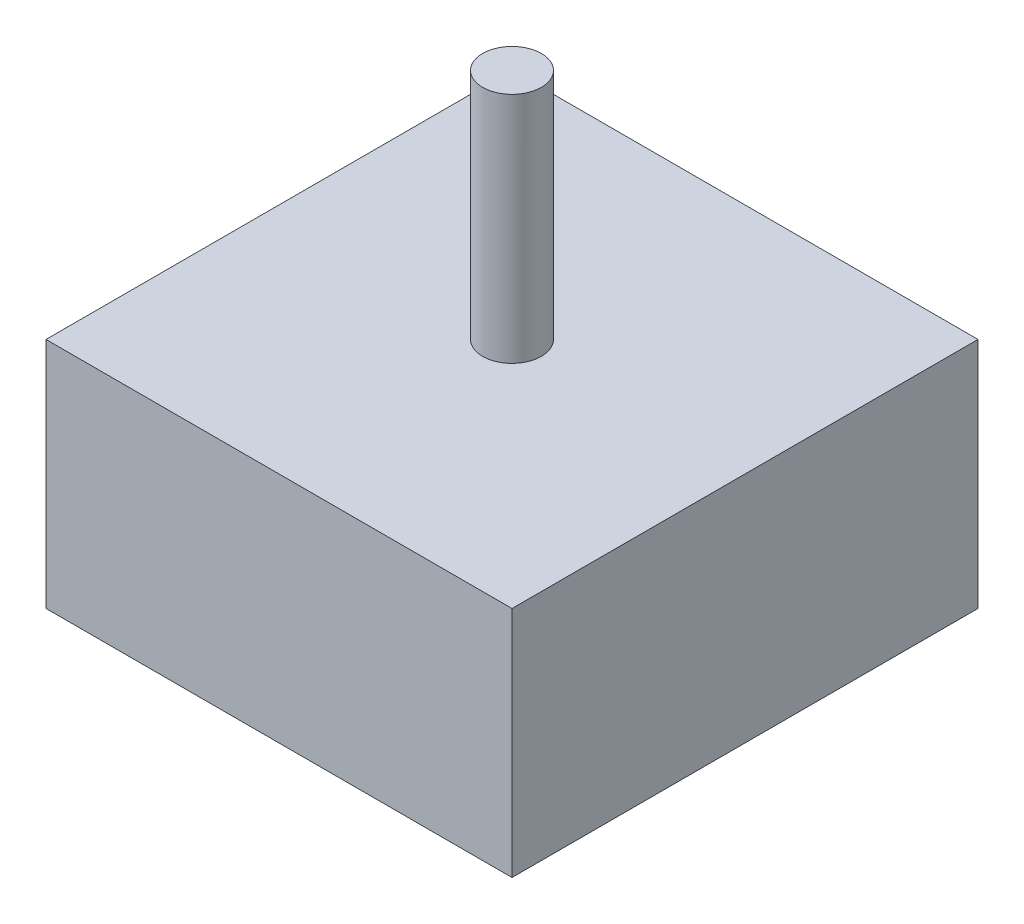
ISO-10303-21;
HEADER;
FILE_DESCRIPTION(('STEP AP214'),'2;1');
FILE_NAME('part.step','',(''),(''),'','','');
FILE_SCHEMA(('AUTOMOTIVE_DESIGN { 1 0 10303 214 1 1 1 1 }'));
ENDSEC;
DATA;
#1=APPLICATION_CONTEXT('core data for automotive mechanical design processes');
#2=APPLICATION_PROTOCOL_DEFINITION('international standard','automotive_design',2000,#1);
#3=PRODUCT_CONTEXT('',#1,'mechanical');
#4=PRODUCT('Part','Part','',(#3));
#5=PRODUCT_RELATED_PRODUCT_CATEGORY('part','',(#4));
#6=PRODUCT_DEFINITION_FORMATION('','',#4);
#7=PRODUCT_DEFINITION_CONTEXT('part definition',#1,'design');
#8=PRODUCT_DEFINITION('design','',#6,#7);
#9=PRODUCT_DEFINITION_SHAPE('','',#8);
#10=(LENGTH_UNIT() NAMED_UNIT(*) SI_UNIT(.MILLI.,.METRE.));
#11=(NAMED_UNIT(*) PLANE_ANGLE_UNIT() SI_UNIT($,.RADIAN.));
#12=(NAMED_UNIT(*) SI_UNIT($,.STERADIAN.) SOLID_ANGLE_UNIT());
#13=UNCERTAINTY_MEASURE_WITH_UNIT(LENGTH_MEASURE(1.E-05),#10,'distance_accuracy_value','');
#14=(GEOMETRIC_REPRESENTATION_CONTEXT(3) GLOBAL_UNCERTAINTY_ASSIGNED_CONTEXT((#13)) GLOBAL_UNIT_ASSIGNED_CONTEXT((#10,
#11,#12)) REPRESENTATION_CONTEXT('',''));
#15=CARTESIAN_POINT('',(0.,0.,0.));
#16=DIRECTION('',(0.,0.,1.));
#17=DIRECTION('',(1.,0.,0.));
#18=AXIS2_PLACEMENT_3D('',#15,#16,#17);
#19=CARTESIAN_POINT('',(0.,25.,0.));
#20=DIRECTION('',(0.,-1.,0.));
#21=DIRECTION('',(0.,0.,-1.));
#22=AXIS2_PLACEMENT_3D('',#19,#20,#21);
#23=PLANE('',#22);
#24=DIRECTION('',(0.,0.,-1.));
#25=VECTOR('',#24,1.);
#26=CARTESIAN_POINT('',(25.,25.,25.));
#27=LINE('',#26,#25);
#28=CARTESIAN_POINT('',(25.,25.,25.));
#29=VERTEX_POINT('',#28);
#30=CARTESIAN_POINT('',(25.,25.,-25.));
#31=VERTEX_POINT('',#30);
#32=EDGE_CURVE('E150',#29,#31,#27,.T.);
#33=ORIENTED_EDGE('',*,*,#32,.T.);
#34=DIRECTION('',(-1.,0.,0.));
#35=VECTOR('',#34,1.);
#36=CARTESIAN_POINT('',(-25.,25.,-25.));
#37=LINE('',#36,#35);
#38=CARTESIAN_POINT('',(-25.,25.,-25.));
#39=VERTEX_POINT('',#38);
#40=EDGE_CURVE('E86',#31,#39,#37,.T.);
#41=ORIENTED_EDGE('',*,*,#40,.T.);
#42=DIRECTION('',(0.,0.,1.));
#43=VECTOR('',#42,1.);
#44=CARTESIAN_POINT('',(-25.,25.,25.));
#45=LINE('',#44,#43);
#46=CARTESIAN_POINT('',(-25.,25.,25.));
#47=VERTEX_POINT('',#46);
#48=EDGE_CURVE('E153',#39,#47,#45,.T.);
#49=ORIENTED_EDGE('',*,*,#48,.T.);
#50=DIRECTION('',(1.,0.,0.));
#51=VECTOR('',#50,1.);
#52=CARTESIAN_POINT('',(-25.,25.,25.));
#53=LINE('',#52,#51);
#54=EDGE_CURVE('E57',#47,#29,#53,.T.);
#55=ORIENTED_EDGE('',*,*,#54,.T.);
#56=EDGE_LOOP('',(#33,#41,#49,#55));
#57=FACE_BOUND('',#56,.T.);
#58=CARTESIAN_POINT('',(0.,25.,0.));
#59=DIRECTION('',(0.,-1.,0.));
#60=DIRECTION('',(0.,0.,-1.));
#61=AXIS2_PLACEMENT_3D('',#58,#59,#60);
#62=CIRCLE('',#61,3.15);
#63=CARTESIAN_POINT('',(0.,25.,-3.15));
#64=VERTEX_POINT('',#63);
#65=EDGE_CURVE('E11',#64,#64,#62,.F.);
#66=ORIENTED_EDGE('',*,*,#65,.F.);
#67=EDGE_LOOP('',(#66));
#68=FACE_BOUND('',#67,.T.);
#69=ADVANCED_FACE('F33',(#57,#68),#23,.F.);
#70=CARTESIAN_POINT('',(25.,25.,25.));
#71=DIRECTION('',(-1.,0.,0.));
#72=DIRECTION('',(0.,0.,1.));
#73=AXIS2_PLACEMENT_3D('',#70,#71,#72);
#74=PLANE('',#73);
#75=DIRECTION('',(0.,0.,-1.));
#76=VECTOR('',#75,1.);
#77=CARTESIAN_POINT('',(25.,0.,25.));
#78=LINE('',#77,#76);
#79=CARTESIAN_POINT('',(25.,0.,25.));
#80=VERTEX_POINT('',#79);
#81=CARTESIAN_POINT('',(25.,0.,-25.));
#82=VERTEX_POINT('',#81);
#83=EDGE_CURVE('E149',#80,#82,#78,.T.);
#84=ORIENTED_EDGE('',*,*,#83,.T.);
#85=DIRECTION('',(0.,-1.,0.));
#86=VECTOR('',#85,1.);
#87=CARTESIAN_POINT('',(25.,25.,-25.));
#88=LINE('',#87,#86);
#89=EDGE_CURVE('E41',#31,#82,#88,.T.);
#90=ORIENTED_EDGE('',*,*,#89,.F.);
#91=ORIENTED_EDGE('',*,*,#32,.F.);
#92=DIRECTION('',(0.,-1.,0.));
#93=VECTOR('',#92,1.);
#94=CARTESIAN_POINT('',(25.,25.,25.));
#95=LINE('',#94,#93);
#96=EDGE_CURVE('E156',#29,#80,#95,.T.);
#97=ORIENTED_EDGE('',*,*,#96,.T.);
#98=EDGE_LOOP('',(#84,#90,#91,#97));
#99=FACE_BOUND('',#98,.T.);
#100=ADVANCED_FACE('F35',(#99),#74,.F.);
#101=CARTESIAN_POINT('',(-25.,25.,-25.));
#102=DIRECTION('',(0.,0.,1.));
#103=DIRECTION('',(1.,0.,0.));
#104=AXIS2_PLACEMENT_3D('',#101,#102,#103);
#105=PLANE('',#104);
#106=DIRECTION('',(-1.,0.,0.));
#107=VECTOR('',#106,1.);
#108=CARTESIAN_POINT('',(-25.,0.,-25.));
#109=LINE('',#108,#107);
#110=CARTESIAN_POINT('',(-25.,0.,-25.));
#111=VERTEX_POINT('',#110);
#112=EDGE_CURVE('E159',#82,#111,#109,.T.);
#113=ORIENTED_EDGE('',*,*,#112,.T.);
#114=DIRECTION('',(0.,-1.,0.));
#115=VECTOR('',#114,1.);
#116=CARTESIAN_POINT('',(-25.,25.,-25.));
#117=LINE('',#116,#115);
#118=EDGE_CURVE('E167',#39,#111,#117,.T.);
#119=ORIENTED_EDGE('',*,*,#118,.F.);
#120=ORIENTED_EDGE('',*,*,#40,.F.);
#121=ORIENTED_EDGE('',*,*,#89,.T.);
#122=EDGE_LOOP('',(#113,#119,#120,#121));
#123=FACE_BOUND('',#122,.T.);
#124=ADVANCED_FACE('F170',(#123),#105,.F.);
#125=CARTESIAN_POINT('',(-25.,25.,25.));
#126=DIRECTION('',(1.,0.,0.));
#127=DIRECTION('',(0.,0.,-1.));
#128=AXIS2_PLACEMENT_3D('',#125,#126,#127);
#129=PLANE('',#128);
#130=DIRECTION('',(0.,0.,-1.));
#131=VECTOR('',#130,1.);
#132=CARTESIAN_POINT('',(-25.,15.,-2.5));
#133=LINE('',#132,#131);
#134=CARTESIAN_POINT('',(-25.,15.,2.5));
#135=VERTEX_POINT('',#134);
#136=CARTESIAN_POINT('',(-25.,15.,-2.5));
#137=VERTEX_POINT('',#136);
#138=EDGE_CURVE('E137',#135,#137,#133,.T.);
#139=ORIENTED_EDGE('',*,*,#138,.F.);
#140=DIRECTION('',(0.,1.,0.));
#141=VECTOR('',#140,1.);
#142=CARTESIAN_POINT('',(-25.,10.,2.5));
#143=LINE('',#142,#141);
#144=CARTESIAN_POINT('',(-25.,10.,2.5));
#145=VERTEX_POINT('',#144);
#146=EDGE_CURVE('E48',#145,#135,#143,.T.);
#147=ORIENTED_EDGE('',*,*,#146,.F.);
#148=DIRECTION('',(0.,0.,1.));
#149=VECTOR('',#148,1.);
#150=CARTESIAN_POINT('',(-25.,10.,-2.5));
#151=LINE('',#150,#149);
#152=CARTESIAN_POINT('',(-25.,10.,-2.5));
#153=VERTEX_POINT('',#152);
#154=EDGE_CURVE('E128',#153,#145,#151,.T.);
#155=ORIENTED_EDGE('',*,*,#154,.F.);
#156=DIRECTION('',(0.,-1.,0.));
#157=VECTOR('',#156,1.);
#158=CARTESIAN_POINT('',(-25.,10.,-2.5));
#159=LINE('',#158,#157);
#160=EDGE_CURVE('E131',#137,#153,#159,.T.);
#161=ORIENTED_EDGE('',*,*,#160,.F.);
#162=EDGE_LOOP('',(#139,#147,#155,#161));
#163=FACE_BOUND('',#162,.T.);
#164=DIRECTION('',(0.,0.,1.));
#165=VECTOR('',#164,1.);
#166=CARTESIAN_POINT('',(-25.,0.,25.));
#167=LINE('',#166,#165);
#168=CARTESIAN_POINT('',(-25.,0.,25.));
#169=VERTEX_POINT('',#168);
#170=EDGE_CURVE('E161',#111,#169,#167,.T.);
#171=ORIENTED_EDGE('',*,*,#170,.T.);
#172=DIRECTION('',(0.,-1.,0.));
#173=VECTOR('',#172,1.);
#174=CARTESIAN_POINT('',(-25.,25.,25.));
#175=LINE('',#174,#173);
#176=EDGE_CURVE('E165',#47,#169,#175,.T.);
#177=ORIENTED_EDGE('',*,*,#176,.F.);
#178=ORIENTED_EDGE('',*,*,#48,.F.);
#179=ORIENTED_EDGE('',*,*,#118,.T.);
#180=EDGE_LOOP('',(#171,#177,#178,#179));
#181=FACE_BOUND('',#180,.T.);
#182=ADVANCED_FACE('F179',(#163,#181),#129,.F.);
#183=CARTESIAN_POINT('',(-25.,25.,25.));
#184=DIRECTION('',(0.,0.,-1.));
#185=DIRECTION('',(-1.,0.,0.));
#186=AXIS2_PLACEMENT_3D('',#183,#184,#185);
#187=PLANE('',#186);
#188=DIRECTION('',(1.,0.,0.));
#189=VECTOR('',#188,1.);
#190=CARTESIAN_POINT('',(-25.,0.,25.));
#191=LINE('',#190,#189);
#192=EDGE_CURVE('E78',#169,#80,#191,.T.);
#193=ORIENTED_EDGE('',*,*,#192,.T.);
#194=ORIENTED_EDGE('',*,*,#96,.F.);
#195=ORIENTED_EDGE('',*,*,#54,.F.);
#196=ORIENTED_EDGE('',*,*,#176,.T.);
#197=EDGE_LOOP('',(#193,#194,#195,#196));
#198=FACE_BOUND('',#197,.T.);
#199=ADVANCED_FACE('F181',(#198),#187,.F.);
#200=CARTESIAN_POINT('',(0.,0.,0.));
#201=DIRECTION('',(0.,-1.,0.));
#202=DIRECTION('',(0.,0.,-1.));
#203=AXIS2_PLACEMENT_3D('',#200,#201,#202);
#204=PLANE('',#203);
#205=ORIENTED_EDGE('',*,*,#83,.F.);
#206=ORIENTED_EDGE('',*,*,#192,.F.);
#207=ORIENTED_EDGE('',*,*,#170,.F.);
#208=ORIENTED_EDGE('',*,*,#112,.F.);
#209=EDGE_LOOP('',(#205,#206,#207,#208));
#210=FACE_BOUND('',#209,.T.);
#211=ADVANCED_FACE('F175',(#210),#204,.T.);
#212=CARTESIAN_POINT('',(0.,50.,0.));
#213=DIRECTION('',(0.,-1.,0.));
#214=DIRECTION('',(0.,0.,-1.));
#215=AXIS2_PLACEMENT_3D('',#212,#213,#214);
#216=CYLINDRICAL_SURFACE('',#215,3.15);
#217=CARTESIAN_POINT('',(0.,50.,0.));
#218=DIRECTION('',(0.,1.,0.));
#219=DIRECTION('',(0.,0.,1.));
#220=AXIS2_PLACEMENT_3D('',#217,#218,#219);
#221=CIRCLE('',#220,3.15);
#222=CARTESIAN_POINT('',(0.,50.,3.15));
#223=VERTEX_POINT('',#222);
#224=EDGE_CURVE('E143',#223,#223,#221,.T.);
#225=ORIENTED_EDGE('',*,*,#224,.F.);
#226=EDGE_LOOP('',(#225));
#227=FACE_BOUND('',#226,.T.);
#228=ORIENTED_EDGE('',*,*,#65,.T.);
#229=EDGE_LOOP('',(#228));
#230=FACE_BOUND('',#229,.T.);
#231=ADVANCED_FACE('F187',(#227,#230),#216,.T.);
#232=CARTESIAN_POINT('',(0.,50.,0.));
#233=DIRECTION('',(0.,1.,0.));
#234=DIRECTION('',(0.,0.,1.));
#235=AXIS2_PLACEMENT_3D('',#232,#233,#234);
#236=PLANE('',#235);
#237=ORIENTED_EDGE('',*,*,#224,.T.);
#238=EDGE_LOOP('',(#237));
#239=FACE_BOUND('',#238,.T.);
#240=ADVANCED_FACE('F189',(#239),#236,.T.);
#241=CARTESIAN_POINT('',(-19.,10.,2.5));
#242=DIRECTION('',(0.,0.,1.));
#243=DIRECTION('',(1.,0.,0.));
#244=AXIS2_PLACEMENT_3D('',#241,#242,#243);
#245=PLANE('',#244);
#246=ORIENTED_EDGE('',*,*,#146,.T.);
#247=DIRECTION('',(-1.,0.,0.));
#248=VECTOR('',#247,1.);
#249=CARTESIAN_POINT('',(-19.,15.,2.5));
#250=LINE('',#249,#248);
#251=CARTESIAN_POINT('',(-19.,15.,2.5));
#252=VERTEX_POINT('',#251);
#253=EDGE_CURVE('E106',#252,#135,#250,.T.);
#254=ORIENTED_EDGE('',*,*,#253,.F.);
#255=DIRECTION('',(0.,1.,0.));
#256=VECTOR('',#255,1.);
#257=CARTESIAN_POINT('',(-19.,10.,2.5));
#258=LINE('',#257,#256);
#259=CARTESIAN_POINT('',(-19.,10.,2.5));
#260=VERTEX_POINT('',#259);
#261=EDGE_CURVE('E110',#260,#252,#258,.T.);
#262=ORIENTED_EDGE('',*,*,#261,.F.);
#263=DIRECTION('',(-1.,0.,0.));
#264=VECTOR('',#263,1.);
#265=CARTESIAN_POINT('',(-19.,10.,2.5));
#266=LINE('',#265,#264);
#267=EDGE_CURVE('E141',#260,#145,#266,.T.);
#268=ORIENTED_EDGE('',*,*,#267,.T.);
#269=EDGE_LOOP('',(#246,#254,#262,#268));
#270=FACE_BOUND('',#269,.T.);
#271=ADVANCED_FACE('F108',(#270),#245,.F.);
#272=CARTESIAN_POINT('',(-19.,10.,-2.5));
#273=DIRECTION('',(0.,-1.,0.));
#274=DIRECTION('',(0.,0.,-1.));
#275=AXIS2_PLACEMENT_3D('',#272,#273,#274);
#276=PLANE('',#275);
#277=ORIENTED_EDGE('',*,*,#154,.T.);
#278=ORIENTED_EDGE('',*,*,#267,.F.);
#279=DIRECTION('',(0.,0.,1.));
#280=VECTOR('',#279,1.);
#281=CARTESIAN_POINT('',(-19.,10.,-2.5));
#282=LINE('',#281,#280);
#283=CARTESIAN_POINT('',(-19.,10.,-2.5));
#284=VERTEX_POINT('',#283);
#285=EDGE_CURVE('E116',#284,#260,#282,.T.);
#286=ORIENTED_EDGE('',*,*,#285,.F.);
#287=DIRECTION('',(-1.,0.,0.));
#288=VECTOR('',#287,1.);
#289=CARTESIAN_POINT('',(-19.,10.,-2.5));
#290=LINE('',#289,#288);
#291=EDGE_CURVE('E144',#284,#153,#290,.T.);
#292=ORIENTED_EDGE('',*,*,#291,.T.);
#293=EDGE_LOOP('',(#277,#278,#286,#292));
#294=FACE_BOUND('',#293,.T.);
#295=ADVANCED_FACE('F247',(#294),#276,.F.);
#296=CARTESIAN_POINT('',(-19.,10.,-2.5));
#297=DIRECTION('',(0.,0.,-1.));
#298=DIRECTION('',(-1.,0.,0.));
#299=AXIS2_PLACEMENT_3D('',#296,#297,#298);
#300=PLANE('',#299);
#301=ORIENTED_EDGE('',*,*,#160,.T.);
#302=ORIENTED_EDGE('',*,*,#291,.F.);
#303=DIRECTION('',(0.,-1.,0.));
#304=VECTOR('',#303,1.);
#305=CARTESIAN_POINT('',(-19.,10.,-2.5));
#306=LINE('',#305,#304);
#307=CARTESIAN_POINT('',(-19.,15.,-2.5));
#308=VERTEX_POINT('',#307);
#309=EDGE_CURVE('E124',#308,#284,#306,.T.);
#310=ORIENTED_EDGE('',*,*,#309,.F.);
#311=DIRECTION('',(-1.,0.,0.));
#312=VECTOR('',#311,1.);
#313=CARTESIAN_POINT('',(-19.,15.,-2.5));
#314=LINE('',#313,#312);
#315=EDGE_CURVE('E115',#308,#137,#314,.T.);
#316=ORIENTED_EDGE('',*,*,#315,.T.);
#317=EDGE_LOOP('',(#301,#302,#310,#316));
#318=FACE_BOUND('',#317,.T.);
#319=ADVANCED_FACE('F255',(#318),#300,.F.);
#320=CARTESIAN_POINT('',(-19.,15.,-2.5));
#321=DIRECTION('',(0.,1.,0.));
#322=DIRECTION('',(0.,0.,1.));
#323=AXIS2_PLACEMENT_3D('',#320,#321,#322);
#324=PLANE('',#323);
#325=ORIENTED_EDGE('',*,*,#138,.T.);
#326=ORIENTED_EDGE('',*,*,#315,.F.);
#327=DIRECTION('',(0.,0.,-1.));
#328=VECTOR('',#327,1.);
#329=CARTESIAN_POINT('',(-19.,15.,-2.5));
#330=LINE('',#329,#328);
#331=EDGE_CURVE('E119',#252,#308,#330,.T.);
#332=ORIENTED_EDGE('',*,*,#331,.F.);
#333=ORIENTED_EDGE('',*,*,#253,.T.);
#334=EDGE_LOOP('',(#325,#326,#332,#333));
#335=FACE_BOUND('',#334,.T.);
#336=ADVANCED_FACE('F120',(#335),#324,.F.);
#337=CARTESIAN_POINT('',(-19.,0.,0.));
#338=DIRECTION('',(1.,0.,0.));
#339=DIRECTION('',(0.,0.,-1.));
#340=AXIS2_PLACEMENT_3D('',#337,#338,#339);
#341=PLANE('',#340);
#342=ORIENTED_EDGE('',*,*,#261,.T.);
#343=ORIENTED_EDGE('',*,*,#331,.T.);
#344=ORIENTED_EDGE('',*,*,#309,.T.);
#345=ORIENTED_EDGE('',*,*,#285,.T.);
#346=EDGE_LOOP('',(#342,#343,#344,#345));
#347=FACE_BOUND('',#346,.T.);
#348=ADVANCED_FACE('F126',(#347),#341,.F.);
#349=CLOSED_SHELL('',(#69,#100,#124,#182,#199,#211,#231,#240,#271,#295,#319,#336,#348));
#350=MANIFOLD_SOLID_BREP('B2',#349);
#351=ADVANCED_BREP_SHAPE_REPRESENTATION('',(#18,#350),#14);
#352=SHAPE_DEFINITION_REPRESENTATION(#9,#351);
ENDSEC;
END-ISO-10303-21;
